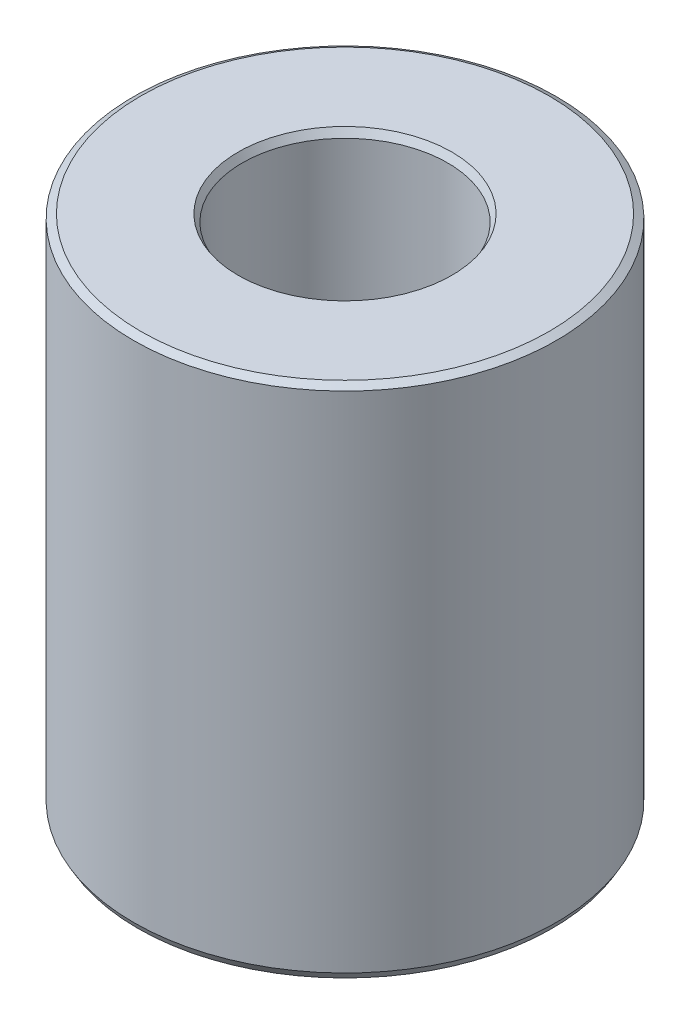
ISO-10303-21;
HEADER;
FILE_DESCRIPTION(('STEP AP214'),'2;1');
FILE_NAME('part.step','',(''),(''),'','','');
FILE_SCHEMA(('AUTOMOTIVE_DESIGN { 1 0 10303 214 1 1 1 1 }'));
ENDSEC;
DATA;
#1=APPLICATION_CONTEXT('core data for automotive mechanical design processes');
#2=APPLICATION_PROTOCOL_DEFINITION('international standard','automotive_design',2000,#1);
#3=PRODUCT_CONTEXT('',#1,'mechanical');
#4=PRODUCT('Part','Part','',(#3));
#5=PRODUCT_RELATED_PRODUCT_CATEGORY('part','',(#4));
#6=PRODUCT_DEFINITION_FORMATION('','',#4);
#7=PRODUCT_DEFINITION_CONTEXT('part definition',#1,'design');
#8=PRODUCT_DEFINITION('design','',#6,#7);
#9=PRODUCT_DEFINITION_SHAPE('','',#8);
#10=(LENGTH_UNIT() NAMED_UNIT(*) SI_UNIT(.MILLI.,.METRE.));
#11=(NAMED_UNIT(*) PLANE_ANGLE_UNIT() SI_UNIT($,.RADIAN.));
#12=(NAMED_UNIT(*) SI_UNIT($,.STERADIAN.) SOLID_ANGLE_UNIT());
#13=UNCERTAINTY_MEASURE_WITH_UNIT(LENGTH_MEASURE(1.E-05),#10,'distance_accuracy_value','');
#14=(GEOMETRIC_REPRESENTATION_CONTEXT(3) GLOBAL_UNCERTAINTY_ASSIGNED_CONTEXT((#13)) GLOBAL_UNIT_ASSIGNED_CONTEXT((#10,
#11,#12)) REPRESENTATION_CONTEXT('',''));
#15=CARTESIAN_POINT('',(0.,0.,0.));
#16=DIRECTION('',(0.,0.,1.));
#17=DIRECTION('',(1.,0.,0.));
#18=AXIS2_PLACEMENT_3D('',#15,#16,#17);
#19=CARTESIAN_POINT('',(0.,48.7776072802089,0.));
#20=DIRECTION('',(0.,-1.,0.));
#21=DIRECTION('',(0.,0.,-1.));
#22=AXIS2_PLACEMENT_3D('',#19,#20,#21);
#23=CYLINDRICAL_SURFACE('',#22,20.);
#24=CARTESIAN_POINT('',(0.,0.689006127034514,0.));
#25=DIRECTION('',(0.,1.,0.));
#26=DIRECTION('',(0.,0.,1.));
#27=AXIS2_PLACEMENT_3D('',#24,#25,#26);
#28=CIRCLE('',#27,20.);
#29=CARTESIAN_POINT('',(0.,0.689006127034514,20.));
#30=VERTEX_POINT('',#29);
#31=EDGE_CURVE('E10',#30,#30,#28,.T.);
#32=ORIENTED_EDGE('',*,*,#31,.T.);
#33=EDGE_LOOP('',(#32));
#34=FACE_BOUND('',#33,.T.);
#35=CARTESIAN_POINT('',(0.,48.3798094072922,0.));
#36=DIRECTION('',(0.,1.,0.));
#37=DIRECTION('',(0.,0.,1.));
#38=AXIS2_PLACEMENT_3D('',#35,#36,#37);
#39=CIRCLE('',#38,20.);
#40=CARTESIAN_POINT('',(0.,48.3798094072922,20.));
#41=VERTEX_POINT('',#40);
#42=EDGE_CURVE('E50',#41,#41,#39,.F.);
#43=ORIENTED_EDGE('',*,*,#42,.T.);
#44=EDGE_LOOP('',(#43));
#45=FACE_BOUND('',#44,.T.);
#46=ADVANCED_FACE('F39',(#34,#45),#23,.T.);
#47=CARTESIAN_POINT('',(0.,48.7776072802089,0.));
#48=DIRECTION('',(0.,1.,0.));
#49=DIRECTION('',(0.,0.,1.));
#50=AXIS2_PLACEMENT_3D('',#47,#48,#49);
#51=PLANE('',#50);
#52=CARTESIAN_POINT('',(0.,48.7776072802089,0.));
#53=DIRECTION('',(0.,1.,0.));
#54=DIRECTION('',(0.,0.,1.));
#55=AXIS2_PLACEMENT_3D('',#52,#53,#54);
#56=CIRCLE('',#55,10.1126643694289);
#57=CARTESIAN_POINT('',(0.,48.7776072802089,10.1126643694289));
#58=VERTEX_POINT('',#57);
#59=EDGE_CURVE('E58',#58,#58,#56,.F.);
#60=ORIENTED_EDGE('',*,*,#59,.T.);
#61=EDGE_LOOP('',(#60));
#62=FACE_BOUND('',#61,.T.);
#63=CARTESIAN_POINT('',(0.,48.7776072802089,0.));
#64=DIRECTION('',(0.,1.,0.));
#65=DIRECTION('',(0.,0.,1.));
#66=AXIS2_PLACEMENT_3D('',#63,#64,#65);
#67=CIRCLE('',#66,19.3109938729654);
#68=CARTESIAN_POINT('',(0.,48.7776072802089,19.3109938729654));
#69=VERTEX_POINT('',#68);
#70=EDGE_CURVE('E61',#69,#69,#67,.T.);
#71=ORIENTED_EDGE('',*,*,#70,.T.);
#72=EDGE_LOOP('',(#71));
#73=FACE_BOUND('',#72,.T.);
#74=ADVANCED_FACE('F88',(#62,#73),#51,.T.);
#75=CARTESIAN_POINT('',(0.,0.,0.));
#76=DIRECTION('',(0.,1.,0.));
#77=DIRECTION('',(0.,0.,1.));
#78=AXIS2_PLACEMENT_3D('',#75,#76,#77);
#79=PLANE('',#78);
#80=CARTESIAN_POINT('',(0.,0.,0.));
#81=DIRECTION('',(0.,1.,0.));
#82=DIRECTION('',(0.,0.,1.));
#83=AXIS2_PLACEMENT_3D('',#80,#81,#82);
#84=CIRCLE('',#83,10.4038726235467);
#85=CARTESIAN_POINT('',(0.,0.,10.4038726235467));
#86=VERTEX_POINT('',#85);
#87=EDGE_CURVE('E51',#86,#86,#84,.T.);
#88=ORIENTED_EDGE('',*,*,#87,.T.);
#89=EDGE_LOOP('',(#88));
#90=FACE_BOUND('',#89,.T.);
#91=CARTESIAN_POINT('',(0.,0.,0.));
#92=DIRECTION('',(0.,1.,0.));
#93=DIRECTION('',(0.,0.,1.));
#94=AXIS2_PLACEMENT_3D('',#91,#92,#93);
#95=CIRCLE('',#94,19.6022021270833);
#96=CARTESIAN_POINT('',(0.,0.,19.6022021270833));
#97=VERTEX_POINT('',#96);
#98=EDGE_CURVE('E54',#97,#97,#95,.F.);
#99=ORIENTED_EDGE('',*,*,#98,.T.);
#100=EDGE_LOOP('',(#99));
#101=FACE_BOUND('',#100,.T.);
#102=ADVANCED_FACE('F83',(#90,#101),#79,.F.);
#103=CARTESIAN_POINT('',(0.,48.7776072802089,0.));
#104=DIRECTION('',(0.,-1.,0.));
#105=DIRECTION('',(0.,0.,-1.));
#106=AXIS2_PLACEMENT_3D('',#103,#104,#105);
#107=CYLINDRICAL_SURFACE('',#106,9.7148664965122);
#108=CARTESIAN_POINT('',(0.,48.0886011531744,0.));
#109=DIRECTION('',(0.,1.,0.));
#110=DIRECTION('',(0.,0.,1.));
#111=AXIS2_PLACEMENT_3D('',#108,#109,#110);
#112=CIRCLE('',#111,9.7148664965122);
#113=CARTESIAN_POINT('',(0.,48.0886011531744,9.7148664965122));
#114=VERTEX_POINT('',#113);
#115=EDGE_CURVE('E67',#114,#114,#112,.T.);
#116=ORIENTED_EDGE('',*,*,#115,.T.);
#117=EDGE_LOOP('',(#116));
#118=FACE_BOUND('',#117,.T.);
#119=CARTESIAN_POINT('',(0.,0.397797872916689,0.));
#120=DIRECTION('',(0.,1.,0.));
#121=DIRECTION('',(0.,0.,1.));
#122=AXIS2_PLACEMENT_3D('',#119,#120,#121);
#123=CIRCLE('',#122,9.7148664965122);
#124=CARTESIAN_POINT('',(0.,0.397797872916689,9.7148664965122));
#125=VERTEX_POINT('',#124);
#126=EDGE_CURVE('E69',#125,#125,#123,.F.);
#127=ORIENTED_EDGE('',*,*,#126,.T.);
#128=EDGE_LOOP('',(#127));
#129=FACE_BOUND('',#128,.T.);
#130=ADVANCED_FACE('F71',(#118,#129),#107,.F.);
#131=CARTESIAN_POINT('',(0.,48.0886011531744,0.));
#132=DIRECTION('',(0.,1.,0.));
#133=DIRECTION('',(0.,0.,1.));
#134=AXIS2_PLACEMENT_3D('',#131,#132,#133);
#135=CONICAL_SURFACE('',#134,9.7148664965122,0.523598775598308);
#136=ORIENTED_EDGE('',*,*,#59,.F.);
#137=EDGE_LOOP('',(#136));
#138=FACE_BOUND('',#137,.T.);
#139=ORIENTED_EDGE('',*,*,#115,.F.);
#140=EDGE_LOOP('',(#139));
#141=FACE_BOUND('',#140,.T.);
#142=ADVANCED_FACE('F77',(#138,#141),#135,.F.);
#143=CARTESIAN_POINT('',(0.,0.,0.));
#144=DIRECTION('',(0.,-1.,0.));
#145=DIRECTION('',(0.,0.,-1.));
#146=AXIS2_PLACEMENT_3D('',#143,#144,#145);
#147=CONICAL_SURFACE('',#146,10.4038726235467,1.0471975511966);
#148=ORIENTED_EDGE('',*,*,#126,.F.);
#149=EDGE_LOOP('',(#148));
#150=FACE_BOUND('',#149,.T.);
#151=ORIENTED_EDGE('',*,*,#87,.F.);
#152=EDGE_LOOP('',(#151));
#153=FACE_BOUND('',#152,.T.);
#154=ADVANCED_FACE('F73',(#150,#153),#147,.F.);
#155=CARTESIAN_POINT('',(0.,0.689006127034514,0.));
#156=DIRECTION('',(0.,1.,0.));
#157=DIRECTION('',(0.,0.,1.));
#158=AXIS2_PLACEMENT_3D('',#155,#156,#157);
#159=CONICAL_SURFACE('',#158,20.,0.523598775598314);
#160=ORIENTED_EDGE('',*,*,#98,.F.);
#161=EDGE_LOOP('',(#160));
#162=FACE_BOUND('',#161,.T.);
#163=ORIENTED_EDGE('',*,*,#31,.F.);
#164=EDGE_LOOP('',(#163));
#165=FACE_BOUND('',#164,.T.);
#166=ADVANCED_FACE('F76',(#162,#165),#159,.T.);
#167=CARTESIAN_POINT('',(0.,48.7776072802089,0.));
#168=DIRECTION('',(0.,-1.,0.));
#169=DIRECTION('',(0.,0.,-1.));
#170=AXIS2_PLACEMENT_3D('',#167,#168,#169);
#171=CONICAL_SURFACE('',#170,19.3109938729654,1.0471975511966);
#172=ORIENTED_EDGE('',*,*,#42,.F.);
#173=EDGE_LOOP('',(#172));
#174=FACE_BOUND('',#173,.T.);
#175=ORIENTED_EDGE('',*,*,#70,.F.);
#176=EDGE_LOOP('',(#175));
#177=FACE_BOUND('',#176,.T.);
#178=ADVANCED_FACE('F45',(#174,#177),#171,.T.);
#179=CLOSED_SHELL('',(#46,#74,#102,#130,#142,#154,#166,#178));
#180=MANIFOLD_SOLID_BREP('B2',#179);
#181=ADVANCED_BREP_SHAPE_REPRESENTATION('',(#18,#180),#14);
#182=SHAPE_DEFINITION_REPRESENTATION(#9,#181);
ENDSEC;
END-ISO-10303-21;
